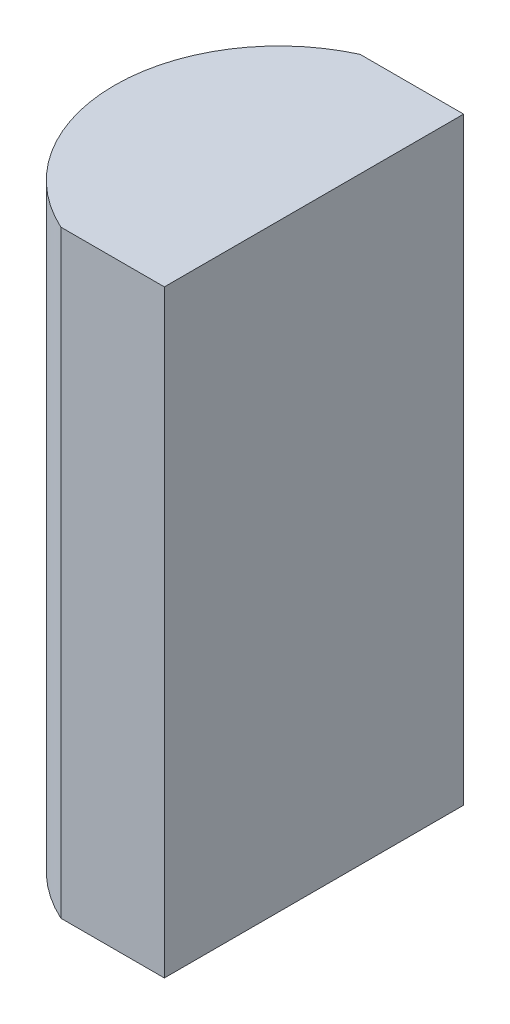
ISO-10303-21;
HEADER;
FILE_DESCRIPTION(('STEP AP214'),'2;1');
FILE_NAME('part.step','',(''),(''),'','','');
FILE_SCHEMA(('AUTOMOTIVE_DESIGN { 1 0 10303 214 1 1 1 1 }'));
ENDSEC;
DATA;
#1=APPLICATION_CONTEXT('core data for automotive mechanical design processes');
#2=APPLICATION_PROTOCOL_DEFINITION('international standard','automotive_design',2000,#1);
#3=PRODUCT_CONTEXT('',#1,'mechanical');
#4=PRODUCT('Part','Part','',(#3));
#5=PRODUCT_RELATED_PRODUCT_CATEGORY('part','',(#4));
#6=PRODUCT_DEFINITION_FORMATION('','',#4);
#7=PRODUCT_DEFINITION_CONTEXT('part definition',#1,'design');
#8=PRODUCT_DEFINITION('design','',#6,#7);
#9=PRODUCT_DEFINITION_SHAPE('','',#8);
#10=(LENGTH_UNIT() NAMED_UNIT(*) SI_UNIT(.MILLI.,.METRE.));
#11=(NAMED_UNIT(*) PLANE_ANGLE_UNIT() SI_UNIT($,.RADIAN.));
#12=(NAMED_UNIT(*) SI_UNIT($,.STERADIAN.) SOLID_ANGLE_UNIT());
#13=UNCERTAINTY_MEASURE_WITH_UNIT(LENGTH_MEASURE(1.E-05),#10,'distance_accuracy_value','');
#14=(GEOMETRIC_REPRESENTATION_CONTEXT(3) GLOBAL_UNCERTAINTY_ASSIGNED_CONTEXT((#13)) GLOBAL_UNIT_ASSIGNED_CONTEXT((#10,
#11,#12)) REPRESENTATION_CONTEXT('',''));
#15=CARTESIAN_POINT('',(0.,0.,0.));
#16=DIRECTION('',(0.,0.,1.));
#17=DIRECTION('',(1.,0.,0.));
#18=AXIS2_PLACEMENT_3D('',#15,#16,#17);
#19=CARTESIAN_POINT('',(4.35520433485127,12.,0.));
#20=DIRECTION('',(0.,-1.,0.));
#21=DIRECTION('',(0.,0.,-1.));
#22=AXIS2_PLACEMENT_3D('',#19,#20,#21);
#23=CYLINDRICAL_SURFACE('',#22,3.3);
#24=CARTESIAN_POINT('',(4.35520433485127,0.,0.));
#25=DIRECTION('',(0.,1.,0.));
#26=DIRECTION('',(0.,0.,1.));
#27=AXIS2_PLACEMENT_3D('',#24,#25,#26);
#28=CIRCLE('',#27,3.3);
#29=CARTESIAN_POINT('',(2.98043162636451,0.,-3.));
#30=VERTEX_POINT('',#29);
#31=CARTESIAN_POINT('',(2.98043162636451,0.,3.));
#32=VERTEX_POINT('',#31);
#33=EDGE_CURVE('E100',#30,#32,#28,.T.);
#34=ORIENTED_EDGE('',*,*,#33,.T.);
#35=DIRECTION('',(0.,-1.,0.));
#36=VECTOR('',#35,1.);
#37=CARTESIAN_POINT('',(2.98043162636451,12.,3.));
#38=LINE('',#37,#36);
#39=CARTESIAN_POINT('',(2.98043162636451,12.,3.));
#40=VERTEX_POINT('',#39);
#41=EDGE_CURVE('E11',#40,#32,#38,.T.);
#42=ORIENTED_EDGE('',*,*,#41,.F.);
#43=CARTESIAN_POINT('',(4.35520433485127,12.,0.));
#44=DIRECTION('',(0.,1.,0.));
#45=DIRECTION('',(0.,0.,1.));
#46=AXIS2_PLACEMENT_3D('',#43,#44,#45);
#47=CIRCLE('',#46,3.3);
#48=CARTESIAN_POINT('',(2.98043162636451,12.,-3.));
#49=VERTEX_POINT('',#48);
#50=EDGE_CURVE('E88',#49,#40,#47,.T.);
#51=ORIENTED_EDGE('',*,*,#50,.F.);
#52=DIRECTION('',(0.,-1.,0.));
#53=VECTOR('',#52,1.);
#54=CARTESIAN_POINT('',(2.98043162636451,12.,-3.));
#55=LINE('',#54,#53);
#56=EDGE_CURVE('E96',#49,#30,#55,.T.);
#57=ORIENTED_EDGE('',*,*,#56,.T.);
#58=EDGE_LOOP('',(#34,#42,#51,#57));
#59=FACE_BOUND('',#58,.T.);
#60=ADVANCED_FACE('F37',(#59),#23,.T.);
#61=CARTESIAN_POINT('',(2.98043162636451,12.,3.));
#62=DIRECTION('',(0.,0.,-1.));
#63=DIRECTION('',(-1.,0.,0.));
#64=AXIS2_PLACEMENT_3D('',#61,#62,#63);
#65=PLANE('',#64);
#66=DIRECTION('',(1.,0.,0.));
#67=VECTOR('',#66,1.);
#68=CARTESIAN_POINT('',(2.98043162636451,0.,3.));
#69=LINE('',#68,#67);
#70=CARTESIAN_POINT('',(5.05520433485126,0.,3.));
#71=VERTEX_POINT('',#70);
#72=EDGE_CURVE('E92',#32,#71,#69,.T.);
#73=ORIENTED_EDGE('',*,*,#72,.T.);
#74=DIRECTION('',(0.,-1.,0.));
#75=VECTOR('',#74,1.);
#76=CARTESIAN_POINT('',(5.05520433485126,12.,3.));
#77=LINE('',#76,#75);
#78=CARTESIAN_POINT('',(5.05520433485126,12.,3.));
#79=VERTEX_POINT('',#78);
#80=EDGE_CURVE('E45',#79,#71,#77,.T.);
#81=ORIENTED_EDGE('',*,*,#80,.F.);
#82=DIRECTION('',(1.,0.,0.));
#83=VECTOR('',#82,1.);
#84=CARTESIAN_POINT('',(2.98043162636451,12.,3.));
#85=LINE('',#84,#83);
#86=EDGE_CURVE('E83',#40,#79,#85,.T.);
#87=ORIENTED_EDGE('',*,*,#86,.F.);
#88=ORIENTED_EDGE('',*,*,#41,.T.);
#89=EDGE_LOOP('',(#73,#81,#87,#88));
#90=FACE_BOUND('',#89,.T.);
#91=ADVANCED_FACE('F91',(#90),#65,.F.);
#92=CARTESIAN_POINT('',(5.05520433485126,12.,-3.00000000000001));
#93=DIRECTION('',(-1.,0.,0.));
#94=DIRECTION('',(0.,0.,1.));
#95=AXIS2_PLACEMENT_3D('',#92,#93,#94);
#96=PLANE('',#95);
#97=DIRECTION('',(0.,0.,-1.));
#98=VECTOR('',#97,1.);
#99=CARTESIAN_POINT('',(5.05520433485126,0.,-3.00000000000001));
#100=LINE('',#99,#98);
#101=CARTESIAN_POINT('',(5.05520433485126,0.,-3.00000000000001));
#102=VERTEX_POINT('',#101);
#103=EDGE_CURVE('E70',#71,#102,#100,.T.);
#104=ORIENTED_EDGE('',*,*,#103,.T.);
#105=DIRECTION('',(0.,-1.,0.));
#106=VECTOR('',#105,1.);
#107=CARTESIAN_POINT('',(5.05520433485126,12.,-3.00000000000001));
#108=LINE('',#107,#106);
#109=CARTESIAN_POINT('',(5.05520433485126,12.,-3.00000000000001));
#110=VERTEX_POINT('',#109);
#111=EDGE_CURVE('E93',#110,#102,#108,.T.);
#112=ORIENTED_EDGE('',*,*,#111,.F.);
#113=DIRECTION('',(0.,0.,-1.));
#114=VECTOR('',#113,1.);
#115=CARTESIAN_POINT('',(5.05520433485126,12.,-3.00000000000001));
#116=LINE('',#115,#114);
#117=EDGE_CURVE('E86',#79,#110,#116,.T.);
#118=ORIENTED_EDGE('',*,*,#117,.F.);
#119=ORIENTED_EDGE('',*,*,#80,.T.);
#120=EDGE_LOOP('',(#104,#112,#118,#119));
#121=FACE_BOUND('',#120,.T.);
#122=ADVANCED_FACE('F94',(#121),#96,.F.);
#123=CARTESIAN_POINT('',(2.98043162636451,12.,-3.));
#124=DIRECTION('',(0.,0.,1.));
#125=DIRECTION('',(1.,0.,0.));
#126=AXIS2_PLACEMENT_3D('',#123,#124,#125);
#127=PLANE('',#126);
#128=DIRECTION('',(-1.,0.,0.));
#129=VECTOR('',#128,1.);
#130=CARTESIAN_POINT('',(2.98043162636451,0.,-3.));
#131=LINE('',#130,#129);
#132=EDGE_CURVE('E76',#102,#30,#131,.T.);
#133=ORIENTED_EDGE('',*,*,#132,.T.);
#134=ORIENTED_EDGE('',*,*,#56,.F.);
#135=DIRECTION('',(-1.,0.,0.));
#136=VECTOR('',#135,1.);
#137=CARTESIAN_POINT('',(2.98043162636451,12.,-3.));
#138=LINE('',#137,#136);
#139=EDGE_CURVE('E53',#110,#49,#138,.T.);
#140=ORIENTED_EDGE('',*,*,#139,.F.);
#141=ORIENTED_EDGE('',*,*,#111,.T.);
#142=EDGE_LOOP('',(#133,#134,#140,#141));
#143=FACE_BOUND('',#142,.T.);
#144=ADVANCED_FACE('F107',(#143),#127,.F.);
#145=CARTESIAN_POINT('',(4.35520433485127,12.,0.));
#146=DIRECTION('',(0.,1.,0.));
#147=DIRECTION('',(0.,0.,1.));
#148=AXIS2_PLACEMENT_3D('',#145,#146,#147);
#149=PLANE('',#148);
#150=ORIENTED_EDGE('',*,*,#50,.T.);
#151=ORIENTED_EDGE('',*,*,#86,.T.);
#152=ORIENTED_EDGE('',*,*,#117,.T.);
#153=ORIENTED_EDGE('',*,*,#139,.T.);
#154=EDGE_LOOP('',(#150,#151,#152,#153));
#155=FACE_BOUND('',#154,.T.);
#156=ADVANCED_FACE('F84',(#155),#149,.T.);
#157=CARTESIAN_POINT('',(4.35520433485127,0.,0.));
#158=DIRECTION('',(0.,1.,0.));
#159=DIRECTION('',(0.,0.,1.));
#160=AXIS2_PLACEMENT_3D('',#157,#158,#159);
#161=PLANE('',#160);
#162=ORIENTED_EDGE('',*,*,#33,.F.);
#163=ORIENTED_EDGE('',*,*,#132,.F.);
#164=ORIENTED_EDGE('',*,*,#103,.F.);
#165=ORIENTED_EDGE('',*,*,#72,.F.);
#166=EDGE_LOOP('',(#162,#163,#164,#165));
#167=FACE_BOUND('',#166,.T.);
#168=ADVANCED_FACE('F110',(#167),#161,.F.);
#169=CLOSED_SHELL('',(#60,#91,#122,#144,#156,#168));
#170=MANIFOLD_SOLID_BREP('B2',#169);
#171=ADVANCED_BREP_SHAPE_REPRESENTATION('',(#18,#170),#14);
#172=SHAPE_DEFINITION_REPRESENTATION(#9,#171);
ENDSEC;
END-ISO-10303-21;
